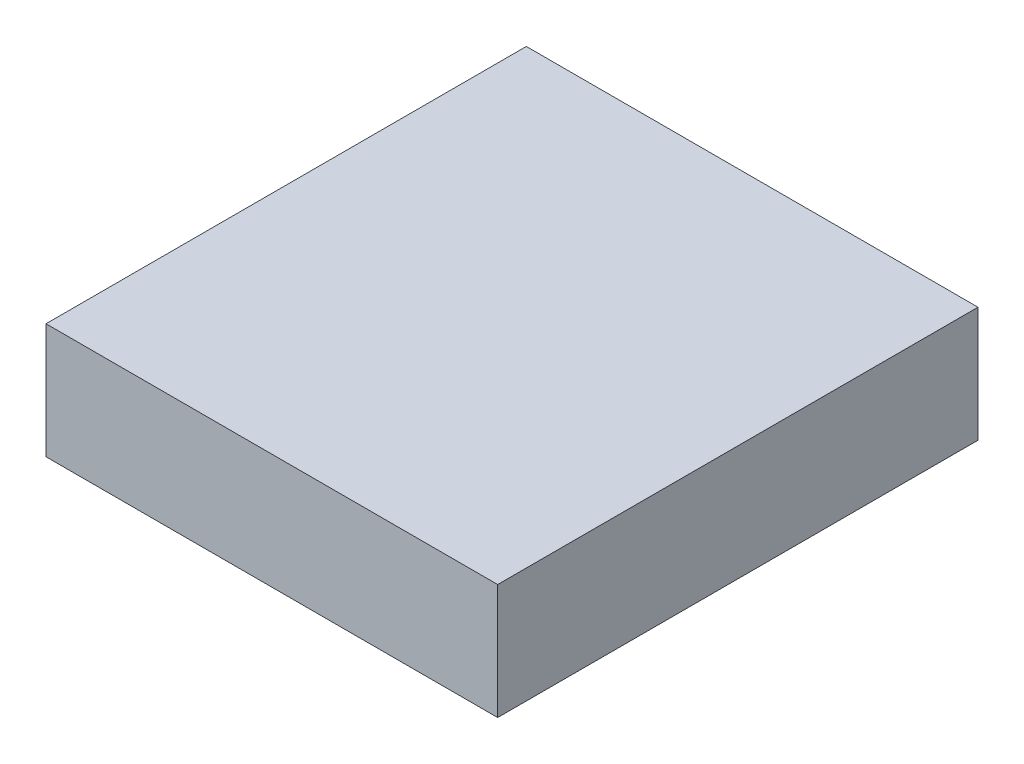
ISO-10303-21;
HEADER;
FILE_DESCRIPTION(('STEP AP214'),'2;1');
FILE_NAME('part.step','',(''),(''),'','','');
FILE_SCHEMA(('AUTOMOTIVE_DESIGN { 1 0 10303 214 1 1 1 1 }'));
ENDSEC;
DATA;
#1=APPLICATION_CONTEXT('core data for automotive mechanical design processes');
#2=APPLICATION_PROTOCOL_DEFINITION('international standard','automotive_design',2000,#1);
#3=PRODUCT_CONTEXT('',#1,'mechanical');
#4=PRODUCT('Part','Part','',(#3));
#5=PRODUCT_RELATED_PRODUCT_CATEGORY('part','',(#4));
#6=PRODUCT_DEFINITION_FORMATION('','',#4);
#7=PRODUCT_DEFINITION_CONTEXT('part definition',#1,'design');
#8=PRODUCT_DEFINITION('design','',#6,#7);
#9=PRODUCT_DEFINITION_SHAPE('','',#8);
#10=(LENGTH_UNIT() NAMED_UNIT(*) SI_UNIT(.MILLI.,.METRE.));
#11=(NAMED_UNIT(*) PLANE_ANGLE_UNIT() SI_UNIT($,.RADIAN.));
#12=(NAMED_UNIT(*) SI_UNIT($,.STERADIAN.) SOLID_ANGLE_UNIT());
#13=UNCERTAINTY_MEASURE_WITH_UNIT(LENGTH_MEASURE(1.E-05),#10,'distance_accuracy_value','');
#14=(GEOMETRIC_REPRESENTATION_CONTEXT(3) GLOBAL_UNCERTAINTY_ASSIGNED_CONTEXT((#13)) GLOBAL_UNIT_ASSIGNED_CONTEXT((#10,
#11,#12)) REPRESENTATION_CONTEXT('',''));
#15=CARTESIAN_POINT('',(0.,0.,0.));
#16=DIRECTION('',(0.,0.,1.));
#17=DIRECTION('',(1.,0.,0.));
#18=AXIS2_PLACEMENT_3D('',#15,#16,#17);
#19=CARTESIAN_POINT('',(-45.085,11.5,-47.895));
#20=DIRECTION('',(1.,0.,0.));
#21=DIRECTION('',(0.,0.,-1.));
#22=AXIS2_PLACEMENT_3D('',#19,#20,#21);
#23=PLANE('',#22);
#24=DIRECTION('',(0.,0.,1.));
#25=VECTOR('',#24,1.);
#26=CARTESIAN_POINT('',(-45.085,-11.5,-47.895));
#27=LINE('',#26,#25);
#28=CARTESIAN_POINT('',(-45.085,-11.5,-47.895));
#29=VERTEX_POINT('',#28);
#30=CARTESIAN_POINT('',(-45.085,-11.5,47.995));
#31=VERTEX_POINT('',#30);
#32=EDGE_CURVE('E113',#29,#31,#27,.T.);
#33=ORIENTED_EDGE('',*,*,#32,.T.);
#34=DIRECTION('',(0.,-1.,0.));
#35=VECTOR('',#34,1.);
#36=CARTESIAN_POINT('',(-45.085,11.5,47.995));
#37=LINE('',#36,#35);
#38=CARTESIAN_POINT('',(-45.085,11.5,47.995));
#39=VERTEX_POINT('',#38);
#40=EDGE_CURVE('E11',#39,#31,#37,.T.);
#41=ORIENTED_EDGE('',*,*,#40,.F.);
#42=DIRECTION('',(0.,0.,1.));
#43=VECTOR('',#42,1.);
#44=CARTESIAN_POINT('',(-45.085,11.5,-47.895));
#45=LINE('',#44,#43);
#46=CARTESIAN_POINT('',(-45.085,11.5,-47.895));
#47=VERTEX_POINT('',#46);
#48=EDGE_CURVE('E97',#47,#39,#45,.T.);
#49=ORIENTED_EDGE('',*,*,#48,.F.);
#50=DIRECTION('',(0.,-1.,0.));
#51=VECTOR('',#50,1.);
#52=CARTESIAN_POINT('',(-45.085,11.5,-47.895));
#53=LINE('',#52,#51);
#54=EDGE_CURVE('E109',#47,#29,#53,.T.);
#55=ORIENTED_EDGE('',*,*,#54,.T.);
#56=EDGE_LOOP('',(#33,#41,#49,#55));
#57=FACE_BOUND('',#56,.T.);
#58=ADVANCED_FACE('F45',(#57),#23,.F.);
#59=CARTESIAN_POINT('',(-45.085,11.5,47.995));
#60=DIRECTION('',(0.,0.,-1.));
#61=DIRECTION('',(-1.,0.,0.));
#62=AXIS2_PLACEMENT_3D('',#59,#60,#61);
#63=PLANE('',#62);
#64=DIRECTION('',(1.,0.,0.));
#65=VECTOR('',#64,1.);
#66=CARTESIAN_POINT('',(-45.085,-11.5,47.995));
#67=LINE('',#66,#65);
#68=CARTESIAN_POINT('',(45.085,-11.5,47.995));
#69=VERTEX_POINT('',#68);
#70=EDGE_CURVE('E102',#31,#69,#67,.T.);
#71=ORIENTED_EDGE('',*,*,#70,.T.);
#72=DIRECTION('',(0.,-1.,0.));
#73=VECTOR('',#72,1.);
#74=CARTESIAN_POINT('',(45.085,11.5,47.995));
#75=LINE('',#74,#73);
#76=CARTESIAN_POINT('',(45.085,11.5,47.995));
#77=VERTEX_POINT('',#76);
#78=EDGE_CURVE('E54',#77,#69,#75,.T.);
#79=ORIENTED_EDGE('',*,*,#78,.F.);
#80=DIRECTION('',(1.,0.,0.));
#81=VECTOR('',#80,1.);
#82=CARTESIAN_POINT('',(-45.085,11.5,47.995));
#83=LINE('',#82,#81);
#84=EDGE_CURVE('E92',#39,#77,#83,.T.);
#85=ORIENTED_EDGE('',*,*,#84,.F.);
#86=ORIENTED_EDGE('',*,*,#40,.T.);
#87=EDGE_LOOP('',(#71,#79,#85,#86));
#88=FACE_BOUND('',#87,.T.);
#89=ADVANCED_FACE('F101',(#88),#63,.F.);
#90=CARTESIAN_POINT('',(45.085,11.5,-47.895));
#91=DIRECTION('',(-1.,0.,0.));
#92=DIRECTION('',(0.,0.,1.));
#93=AXIS2_PLACEMENT_3D('',#90,#91,#92);
#94=PLANE('',#93);
#95=DIRECTION('',(0.,0.,-1.));
#96=VECTOR('',#95,1.);
#97=CARTESIAN_POINT('',(45.085,-11.5,-47.895));
#98=LINE('',#97,#96);
#99=CARTESIAN_POINT('',(45.085,-11.5,-47.895));
#100=VERTEX_POINT('',#99);
#101=EDGE_CURVE('E79',#69,#100,#98,.T.);
#102=ORIENTED_EDGE('',*,*,#101,.T.);
#103=DIRECTION('',(0.,-1.,0.));
#104=VECTOR('',#103,1.);
#105=CARTESIAN_POINT('',(45.085,11.5,-47.895));
#106=LINE('',#105,#104);
#107=CARTESIAN_POINT('',(45.085,11.5,-47.895));
#108=VERTEX_POINT('',#107);
#109=EDGE_CURVE('E104',#108,#100,#106,.T.);
#110=ORIENTED_EDGE('',*,*,#109,.F.);
#111=DIRECTION('',(0.,0.,-1.));
#112=VECTOR('',#111,1.);
#113=CARTESIAN_POINT('',(45.085,11.5,-47.895));
#114=LINE('',#113,#112);
#115=EDGE_CURVE('E95',#77,#108,#114,.T.);
#116=ORIENTED_EDGE('',*,*,#115,.F.);
#117=ORIENTED_EDGE('',*,*,#78,.T.);
#118=EDGE_LOOP('',(#102,#110,#116,#117));
#119=FACE_BOUND('',#118,.T.);
#120=ADVANCED_FACE('F105',(#119),#94,.F.);
#121=CARTESIAN_POINT('',(-45.085,11.5,-47.895));
#122=DIRECTION('',(0.,0.,1.));
#123=DIRECTION('',(1.,0.,0.));
#124=AXIS2_PLACEMENT_3D('',#121,#122,#123);
#125=PLANE('',#124);
#126=DIRECTION('',(-1.,0.,0.));
#127=VECTOR('',#126,1.);
#128=CARTESIAN_POINT('',(-45.085,-11.5,-47.895));
#129=LINE('',#128,#127);
#130=EDGE_CURVE('E85',#100,#29,#129,.T.);
#131=ORIENTED_EDGE('',*,*,#130,.T.);
#132=ORIENTED_EDGE('',*,*,#54,.F.);
#133=DIRECTION('',(-1.,0.,0.));
#134=VECTOR('',#133,1.);
#135=CARTESIAN_POINT('',(-45.085,11.5,-47.895));
#136=LINE('',#135,#134);
#137=EDGE_CURVE('E62',#108,#47,#136,.T.);
#138=ORIENTED_EDGE('',*,*,#137,.F.);
#139=ORIENTED_EDGE('',*,*,#109,.T.);
#140=EDGE_LOOP('',(#131,#132,#138,#139));
#141=FACE_BOUND('',#140,.T.);
#142=ADVANCED_FACE('F126',(#141),#125,.F.);
#143=CARTESIAN_POINT('',(0.,11.5,0.));
#144=DIRECTION('',(0.,1.,0.));
#145=DIRECTION('',(0.,0.,1.));
#146=AXIS2_PLACEMENT_3D('',#143,#144,#145);
#147=PLANE('',#146);
#148=ORIENTED_EDGE('',*,*,#48,.T.);
#149=ORIENTED_EDGE('',*,*,#84,.T.);
#150=ORIENTED_EDGE('',*,*,#115,.T.);
#151=ORIENTED_EDGE('',*,*,#137,.T.);
#152=EDGE_LOOP('',(#148,#149,#150,#151));
#153=FACE_BOUND('',#152,.T.);
#154=ADVANCED_FACE('F93',(#153),#147,.T.);
#155=CARTESIAN_POINT('',(0.,-11.5,0.));
#156=DIRECTION('',(0.,1.,0.));
#157=DIRECTION('',(0.,0.,1.));
#158=AXIS2_PLACEMENT_3D('',#155,#156,#157);
#159=PLANE('',#158);
#160=ORIENTED_EDGE('',*,*,#32,.F.);
#161=ORIENTED_EDGE('',*,*,#130,.F.);
#162=ORIENTED_EDGE('',*,*,#101,.F.);
#163=ORIENTED_EDGE('',*,*,#70,.F.);
#164=EDGE_LOOP('',(#160,#161,#162,#163));
#165=FACE_BOUND('',#164,.T.);
#166=ADVANCED_FACE('F129',(#165),#159,.F.);
#167=CLOSED_SHELL('',(#58,#89,#120,#142,#154,#166));
#168=MANIFOLD_SOLID_BREP('B2',#167);
#169=ADVANCED_BREP_SHAPE_REPRESENTATION('',(#18,#168),#14);
#170=SHAPE_DEFINITION_REPRESENTATION(#9,#169);
ENDSEC;
END-ISO-10303-21;
